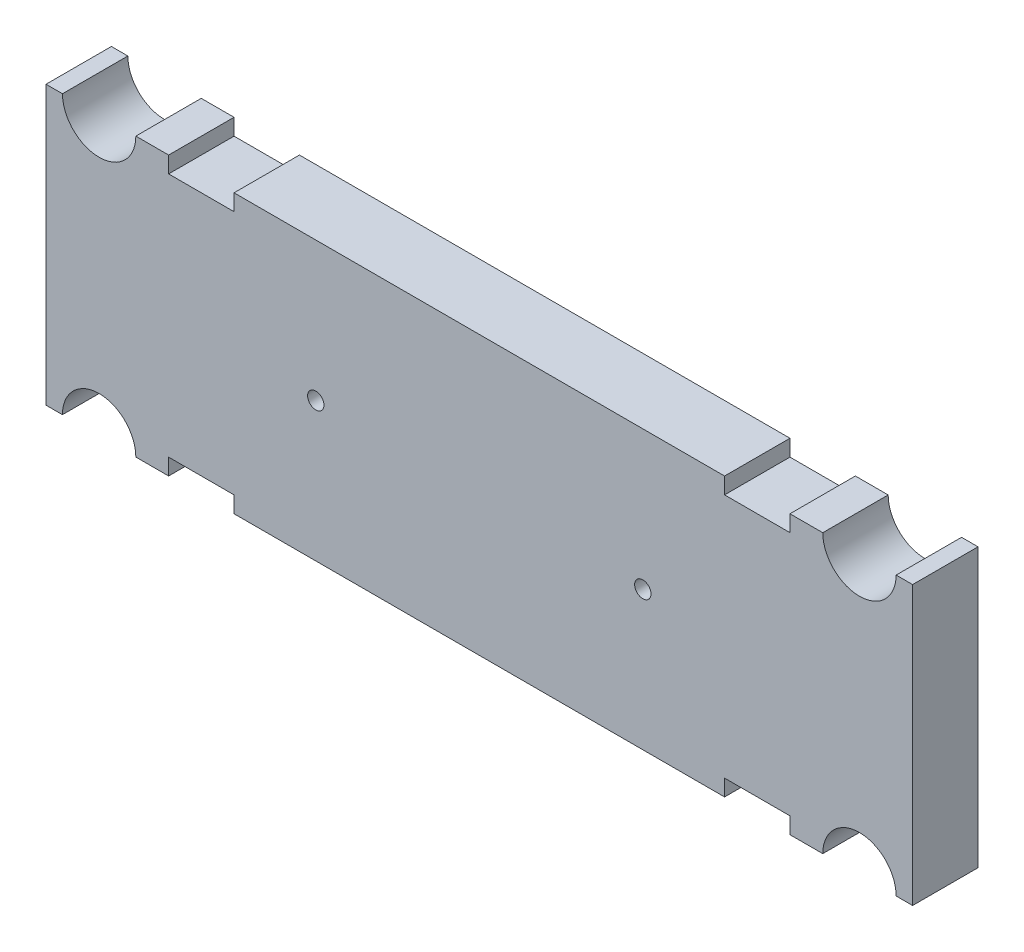
ISO-10303-21;
HEADER;
FILE_DESCRIPTION(('STEP AP214'),'2;1');
FILE_NAME('part.step','',(''),(''),'','','');
FILE_SCHEMA(('AUTOMOTIVE_DESIGN { 1 0 10303 214 1 1 1 1 }'));
ENDSEC;
DATA;
#1=APPLICATION_CONTEXT('core data for automotive mechanical design processes');
#2=APPLICATION_PROTOCOL_DEFINITION('international standard','automotive_design',2000,#1);
#3=PRODUCT_CONTEXT('',#1,'mechanical');
#4=PRODUCT('Part','Part','',(#3));
#5=PRODUCT_RELATED_PRODUCT_CATEGORY('part','',(#4));
#6=PRODUCT_DEFINITION_FORMATION('','',#4);
#7=PRODUCT_DEFINITION_CONTEXT('part definition',#1,'design');
#8=PRODUCT_DEFINITION('design','',#6,#7);
#9=PRODUCT_DEFINITION_SHAPE('','',#8);
#10=(LENGTH_UNIT() NAMED_UNIT(*) SI_UNIT(.MILLI.,.METRE.));
#11=(NAMED_UNIT(*) PLANE_ANGLE_UNIT() SI_UNIT($,.RADIAN.));
#12=(NAMED_UNIT(*) SI_UNIT($,.STERADIAN.) SOLID_ANGLE_UNIT());
#13=UNCERTAINTY_MEASURE_WITH_UNIT(LENGTH_MEASURE(1.E-05),#10,'distance_accuracy_value','');
#14=(GEOMETRIC_REPRESENTATION_CONTEXT(3) GLOBAL_UNCERTAINTY_ASSIGNED_CONTEXT((#13)) GLOBAL_UNIT_ASSIGNED_CONTEXT((#10,
#11,#12)) REPRESENTATION_CONTEXT('',''));
#15=CARTESIAN_POINT('',(0.,0.,0.));
#16=DIRECTION('',(0.,0.,1.));
#17=DIRECTION('',(1.,0.,0.));
#18=AXIS2_PLACEMENT_3D('',#15,#16,#17);
#19=CARTESIAN_POINT('',(23.2500000000001,8.50000000000001,4.));
#20=DIRECTION('',(0.,0.,-1.));
#21=DIRECTION('',(-1.,0.,0.));
#22=AXIS2_PLACEMENT_3D('',#19,#20,#21);
#23=CYLINDRICAL_SURFACE('',#22,2.24362106189331);
#24=CARTESIAN_POINT('',(23.2500000000001,8.50000000000001,0.));
#25=DIRECTION('',(0.,0.,-1.));
#26=DIRECTION('',(-1.,0.,0.));
#27=AXIS2_PLACEMENT_3D('',#24,#25,#26);
#28=CIRCLE('',#27,2.24362106189331);
#29=CARTESIAN_POINT('',(25.4936210618934,8.49999999999999,0.));
#30=VERTEX_POINT('',#29);
#31=CARTESIAN_POINT('',(21.0063789381067,8.5,0.));
#32=VERTEX_POINT('',#31);
#33=EDGE_CURVE('E247',#30,#32,#28,.T.);
#34=ORIENTED_EDGE('',*,*,#33,.T.);
#35=DIRECTION('',(0.,0.,-1.));
#36=VECTOR('',#35,1.);
#37=CARTESIAN_POINT('',(21.0063789381067,8.5,4.));
#38=LINE('',#37,#36);
#39=CARTESIAN_POINT('',(21.0063789381067,8.5,4.));
#40=VERTEX_POINT('',#39);
#41=EDGE_CURVE('E11',#40,#32,#38,.T.);
#42=ORIENTED_EDGE('',*,*,#41,.F.);
#43=CARTESIAN_POINT('',(23.2500000000001,8.50000000000001,4.));
#44=DIRECTION('',(0.,0.,-1.));
#45=DIRECTION('',(-1.,0.,0.));
#46=AXIS2_PLACEMENT_3D('',#43,#44,#45);
#47=CIRCLE('',#46,2.24362106189331);
#48=CARTESIAN_POINT('',(25.4936210618934,8.49999999999999,4.));
#49=VERTEX_POINT('',#48);
#50=EDGE_CURVE('E322',#49,#40,#47,.T.);
#51=ORIENTED_EDGE('',*,*,#50,.F.);
#52=DIRECTION('',(0.,0.,-1.));
#53=VECTOR('',#52,1.);
#54=CARTESIAN_POINT('',(25.4936210618934,8.49999999999999,4.));
#55=LINE('',#54,#53);
#56=EDGE_CURVE('E243',#49,#30,#55,.T.);
#57=ORIENTED_EDGE('',*,*,#56,.T.);
#58=EDGE_LOOP('',(#34,#42,#51,#57));
#59=FACE_BOUND('',#58,.T.);
#60=ADVANCED_FACE('F32',(#59),#23,.F.);
#61=CARTESIAN_POINT('',(21.0063789381067,8.5,4.));
#62=DIRECTION('',(0.,-1.,0.));
#63=DIRECTION('',(1.,0.,0.));
#64=AXIS2_PLACEMENT_3D('',#61,#62,#63);
#65=PLANE('',#64);
#66=DIRECTION('',(-1.,0.,0.));
#67=VECTOR('',#66,1.);
#68=CARTESIAN_POINT('',(21.0063789381067,8.5,0.));
#69=LINE('',#68,#67);
#70=CARTESIAN_POINT('',(19.,8.49999999999999,0.));
#71=VERTEX_POINT('',#70);
#72=EDGE_CURVE('E250',#32,#71,#69,.T.);
#73=ORIENTED_EDGE('',*,*,#72,.T.);
#74=DIRECTION('',(0.,0.,-1.));
#75=VECTOR('',#74,1.);
#76=CARTESIAN_POINT('',(19.,8.49999999999999,4.));
#77=LINE('',#76,#75);
#78=CARTESIAN_POINT('',(19.,8.49999999999999,4.));
#79=VERTEX_POINT('',#78);
#80=EDGE_CURVE('E40',#79,#71,#77,.T.);
#81=ORIENTED_EDGE('',*,*,#80,.F.);
#82=DIRECTION('',(-1.,0.,0.));
#83=VECTOR('',#82,1.);
#84=CARTESIAN_POINT('',(21.0063789381067,8.5,4.));
#85=LINE('',#84,#83);
#86=EDGE_CURVE('E147',#40,#79,#85,.T.);
#87=ORIENTED_EDGE('',*,*,#86,.F.);
#88=ORIENTED_EDGE('',*,*,#41,.T.);
#89=EDGE_LOOP('',(#73,#81,#87,#88));
#90=FACE_BOUND('',#89,.T.);
#91=ADVANCED_FACE('F466',(#90),#65,.F.);
#92=CARTESIAN_POINT('',(19.,8.49999999999999,4.));
#93=DIRECTION('',(1.,0.,0.));
#94=DIRECTION('',(0.,0.,-1.));
#95=AXIS2_PLACEMENT_3D('',#92,#93,#94);
#96=PLANE('',#95);
#97=DIRECTION('',(0.,-1.,0.));
#98=VECTOR('',#97,1.);
#99=CARTESIAN_POINT('',(19.,8.49999999999999,0.));
#100=LINE('',#99,#98);
#101=CARTESIAN_POINT('',(19.,7.5,0.));
#102=VERTEX_POINT('',#101);
#103=EDGE_CURVE('E253',#71,#102,#100,.T.);
#104=ORIENTED_EDGE('',*,*,#103,.T.);
#105=DIRECTION('',(0.,0.,-1.));
#106=VECTOR('',#105,1.);
#107=CARTESIAN_POINT('',(19.,7.5,4.));
#108=LINE('',#107,#106);
#109=CARTESIAN_POINT('',(19.,7.5,4.));
#110=VERTEX_POINT('',#109);
#111=EDGE_CURVE('E371',#110,#102,#108,.T.);
#112=ORIENTED_EDGE('',*,*,#111,.F.);
#113=DIRECTION('',(0.,-1.,0.));
#114=VECTOR('',#113,1.);
#115=CARTESIAN_POINT('',(19.,8.49999999999999,4.));
#116=LINE('',#115,#114);
#117=EDGE_CURVE('E379',#79,#110,#116,.T.);
#118=ORIENTED_EDGE('',*,*,#117,.F.);
#119=ORIENTED_EDGE('',*,*,#80,.T.);
#120=EDGE_LOOP('',(#104,#112,#118,#119));
#121=FACE_BOUND('',#120,.T.);
#122=ADVANCED_FACE('F377',(#121),#96,.F.);
#123=CARTESIAN_POINT('',(19.,7.5,4.));
#124=DIRECTION('',(0.,-1.,0.));
#125=DIRECTION('',(1.,0.,0.));
#126=AXIS2_PLACEMENT_3D('',#123,#124,#125);
#127=PLANE('',#126);
#128=DIRECTION('',(-1.,0.,0.));
#129=VECTOR('',#128,1.);
#130=CARTESIAN_POINT('',(19.,7.5,0.));
#131=LINE('',#130,#129);
#132=CARTESIAN_POINT('',(15.,7.5,0.));
#133=VERTEX_POINT('',#132);
#134=EDGE_CURVE('E255',#102,#133,#131,.T.);
#135=ORIENTED_EDGE('',*,*,#134,.T.);
#136=DIRECTION('',(0.,0.,-1.));
#137=VECTOR('',#136,1.);
#138=CARTESIAN_POINT('',(15.,7.5,4.));
#139=LINE('',#138,#137);
#140=CARTESIAN_POINT('',(15.,7.5,4.));
#141=VERTEX_POINT('',#140);
#142=EDGE_CURVE('E369',#141,#133,#139,.T.);
#143=ORIENTED_EDGE('',*,*,#142,.F.);
#144=DIRECTION('',(-1.,0.,0.));
#145=VECTOR('',#144,1.);
#146=CARTESIAN_POINT('',(19.,7.5,4.));
#147=LINE('',#146,#145);
#148=EDGE_CURVE('E391',#110,#141,#147,.T.);
#149=ORIENTED_EDGE('',*,*,#148,.F.);
#150=ORIENTED_EDGE('',*,*,#111,.T.);
#151=EDGE_LOOP('',(#135,#143,#149,#150));
#152=FACE_BOUND('',#151,.T.);
#153=ADVANCED_FACE('F388',(#152),#127,.F.);
#154=CARTESIAN_POINT('',(15.,8.5,4.));
#155=DIRECTION('',(1.,0.,0.));
#156=DIRECTION('',(0.,1.,0.));
#157=AXIS2_PLACEMENT_3D('',#154,#155,#156);
#158=PLANE('',#157);
#159=DIRECTION('',(0.,-1.,0.));
#160=VECTOR('',#159,1.);
#161=CARTESIAN_POINT('',(15.,8.5,0.));
#162=LINE('',#161,#160);
#163=CARTESIAN_POINT('',(15.,8.5,0.));
#164=VERTEX_POINT('',#163);
#165=EDGE_CURVE('E258',#164,#133,#162,.T.);
#166=ORIENTED_EDGE('',*,*,#165,.F.);
#167=DIRECTION('',(0.,0.,-1.));
#168=VECTOR('',#167,1.);
#169=CARTESIAN_POINT('',(15.,8.5,4.));
#170=LINE('',#169,#168);
#171=CARTESIAN_POINT('',(15.,8.5,4.));
#172=VERTEX_POINT('',#171);
#173=EDGE_CURVE('E367',#172,#164,#170,.T.);
#174=ORIENTED_EDGE('',*,*,#173,.F.);
#175=DIRECTION('',(0.,-1.,0.));
#176=VECTOR('',#175,1.);
#177=CARTESIAN_POINT('',(15.,8.5,4.));
#178=LINE('',#177,#176);
#179=EDGE_CURVE('E393',#172,#141,#178,.T.);
#180=ORIENTED_EDGE('',*,*,#179,.T.);
#181=ORIENTED_EDGE('',*,*,#142,.T.);
#182=EDGE_LOOP('',(#166,#174,#180,#181));
#183=FACE_BOUND('',#182,.T.);
#184=ADVANCED_FACE('F477',(#183),#158,.T.);
#185=CARTESIAN_POINT('',(15.,8.5,4.));
#186=DIRECTION('',(0.,-1.,0.));
#187=DIRECTION('',(1.,0.,0.));
#188=AXIS2_PLACEMENT_3D('',#185,#186,#187);
#189=PLANE('',#188);
#190=DIRECTION('',(-1.,0.,0.));
#191=VECTOR('',#190,1.);
#192=CARTESIAN_POINT('',(15.,8.5,0.));
#193=LINE('',#192,#191);
#194=CARTESIAN_POINT('',(-15.,8.50000000000001,0.));
#195=VERTEX_POINT('',#194);
#196=EDGE_CURVE('E261',#164,#195,#193,.T.);
#197=ORIENTED_EDGE('',*,*,#196,.T.);
#198=DIRECTION('',(0.,0.,-1.));
#199=VECTOR('',#198,1.);
#200=CARTESIAN_POINT('',(-15.,8.50000000000001,4.));
#201=LINE('',#200,#199);
#202=CARTESIAN_POINT('',(-15.,8.50000000000001,4.));
#203=VERTEX_POINT('',#202);
#204=EDGE_CURVE('E364',#203,#195,#201,.T.);
#205=ORIENTED_EDGE('',*,*,#204,.F.);
#206=DIRECTION('',(-1.,0.,0.));
#207=VECTOR('',#206,1.);
#208=CARTESIAN_POINT('',(15.,8.5,4.));
#209=LINE('',#208,#207);
#210=EDGE_CURVE('E395',#172,#203,#209,.T.);
#211=ORIENTED_EDGE('',*,*,#210,.F.);
#212=ORIENTED_EDGE('',*,*,#173,.T.);
#213=EDGE_LOOP('',(#197,#205,#211,#212));
#214=FACE_BOUND('',#213,.T.);
#215=ADVANCED_FACE('F480',(#214),#189,.F.);
#216=CARTESIAN_POINT('',(-15.,8.50000000000001,4.));
#217=DIRECTION('',(1.,0.,0.));
#218=DIRECTION('',(0.,1.,0.));
#219=AXIS2_PLACEMENT_3D('',#216,#217,#218);
#220=PLANE('',#219);
#221=DIRECTION('',(0.,-1.,0.));
#222=VECTOR('',#221,1.);
#223=CARTESIAN_POINT('',(-15.,8.50000000000001,0.));
#224=LINE('',#223,#222);
#225=CARTESIAN_POINT('',(-15.,7.50000000000001,0.));
#226=VERTEX_POINT('',#225);
#227=EDGE_CURVE('E263',#195,#226,#224,.T.);
#228=ORIENTED_EDGE('',*,*,#227,.T.);
#229=DIRECTION('',(0.,0.,-1.));
#230=VECTOR('',#229,1.);
#231=CARTESIAN_POINT('',(-15.,7.50000000000001,4.));
#232=LINE('',#231,#230);
#233=CARTESIAN_POINT('',(-15.,7.50000000000001,4.));
#234=VERTEX_POINT('',#233);
#235=EDGE_CURVE('E362',#234,#226,#232,.T.);
#236=ORIENTED_EDGE('',*,*,#235,.F.);
#237=DIRECTION('',(0.,-1.,0.));
#238=VECTOR('',#237,1.);
#239=CARTESIAN_POINT('',(-15.,8.50000000000001,4.));
#240=LINE('',#239,#238);
#241=EDGE_CURVE('E401',#203,#234,#240,.T.);
#242=ORIENTED_EDGE('',*,*,#241,.F.);
#243=ORIENTED_EDGE('',*,*,#204,.T.);
#244=EDGE_LOOP('',(#228,#236,#242,#243));
#245=FACE_BOUND('',#244,.T.);
#246=ADVANCED_FACE('F484',(#245),#220,.F.);
#247=CARTESIAN_POINT('',(-19.,7.50000000000001,4.));
#248=DIRECTION('',(0.,1.,0.));
#249=DIRECTION('',(-1.,0.,0.));
#250=AXIS2_PLACEMENT_3D('',#247,#248,#249);
#251=PLANE('',#250);
#252=DIRECTION('',(1.,0.,0.));
#253=VECTOR('',#252,1.);
#254=CARTESIAN_POINT('',(-19.,7.50000000000001,0.));
#255=LINE('',#254,#253);
#256=CARTESIAN_POINT('',(-19.,7.50000000000001,0.));
#257=VERTEX_POINT('',#256);
#258=EDGE_CURVE('E266',#257,#226,#255,.T.);
#259=ORIENTED_EDGE('',*,*,#258,.F.);
#260=DIRECTION('',(0.,0.,-1.));
#261=VECTOR('',#260,1.);
#262=CARTESIAN_POINT('',(-19.,7.50000000000001,4.));
#263=LINE('',#262,#261);
#264=CARTESIAN_POINT('',(-19.,7.50000000000001,4.));
#265=VERTEX_POINT('',#264);
#266=EDGE_CURVE('E360',#265,#257,#263,.T.);
#267=ORIENTED_EDGE('',*,*,#266,.F.);
#268=DIRECTION('',(1.,0.,0.));
#269=VECTOR('',#268,1.);
#270=CARTESIAN_POINT('',(-19.,7.50000000000001,4.));
#271=LINE('',#270,#269);
#272=EDGE_CURVE('E403',#265,#234,#271,.T.);
#273=ORIENTED_EDGE('',*,*,#272,.T.);
#274=ORIENTED_EDGE('',*,*,#235,.T.);
#275=EDGE_LOOP('',(#259,#267,#273,#274));
#276=FACE_BOUND('',#275,.T.);
#277=ADVANCED_FACE('F488',(#276),#251,.T.);
#278=CARTESIAN_POINT('',(-19.,8.5,4.));
#279=DIRECTION('',(1.,0.,0.));
#280=DIRECTION('',(0.,0.,-1.));
#281=AXIS2_PLACEMENT_3D('',#278,#279,#280);
#282=PLANE('',#281);
#283=DIRECTION('',(0.,-1.,0.));
#284=VECTOR('',#283,1.);
#285=CARTESIAN_POINT('',(-19.,8.5,0.));
#286=LINE('',#285,#284);
#287=CARTESIAN_POINT('',(-19.,8.5,0.));
#288=VERTEX_POINT('',#287);
#289=EDGE_CURVE('E269',#288,#257,#286,.T.);
#290=ORIENTED_EDGE('',*,*,#289,.F.);
#291=DIRECTION('',(0.,0.,-1.));
#292=VECTOR('',#291,1.);
#293=CARTESIAN_POINT('',(-19.,8.5,4.));
#294=LINE('',#293,#292);
#295=CARTESIAN_POINT('',(-19.,8.5,4.));
#296=VERTEX_POINT('',#295);
#297=EDGE_CURVE('E358',#296,#288,#294,.T.);
#298=ORIENTED_EDGE('',*,*,#297,.F.);
#299=DIRECTION('',(0.,-1.,0.));
#300=VECTOR('',#299,1.);
#301=CARTESIAN_POINT('',(-19.,8.5,4.));
#302=LINE('',#301,#300);
#303=EDGE_CURVE('E406',#296,#265,#302,.T.);
#304=ORIENTED_EDGE('',*,*,#303,.T.);
#305=ORIENTED_EDGE('',*,*,#266,.T.);
#306=EDGE_LOOP('',(#290,#298,#304,#305));
#307=FACE_BOUND('',#306,.T.);
#308=ADVANCED_FACE('F492',(#307),#282,.T.);
#309=CARTESIAN_POINT('',(-19.,8.5,4.));
#310=DIRECTION('',(0.,-1.,0.));
#311=DIRECTION('',(0.,0.,-1.));
#312=AXIS2_PLACEMENT_3D('',#309,#310,#311);
#313=PLANE('',#312);
#314=DIRECTION('',(-1.,0.,0.));
#315=VECTOR('',#314,1.);
#316=CARTESIAN_POINT('',(-19.,8.5,0.));
#317=LINE('',#316,#315);
#318=CARTESIAN_POINT('',(-21.0063789381067,8.5,0.));
#319=VERTEX_POINT('',#318);
#320=EDGE_CURVE('E272',#288,#319,#317,.T.);
#321=ORIENTED_EDGE('',*,*,#320,.T.);
#322=DIRECTION('',(0.,0.,-1.));
#323=VECTOR('',#322,1.);
#324=CARTESIAN_POINT('',(-21.0063789381067,8.5,4.));
#325=LINE('',#324,#323);
#326=CARTESIAN_POINT('',(-21.0063789381067,8.5,4.));
#327=VERTEX_POINT('',#326);
#328=EDGE_CURVE('E356',#327,#319,#325,.T.);
#329=ORIENTED_EDGE('',*,*,#328,.F.);
#330=DIRECTION('',(-1.,0.,0.));
#331=VECTOR('',#330,1.);
#332=CARTESIAN_POINT('',(-19.,8.5,4.));
#333=LINE('',#332,#331);
#334=EDGE_CURVE('E409',#296,#327,#333,.T.);
#335=ORIENTED_EDGE('',*,*,#334,.F.);
#336=ORIENTED_EDGE('',*,*,#297,.T.);
#337=EDGE_LOOP('',(#321,#329,#335,#336));
#338=FACE_BOUND('',#337,.T.);
#339=ADVANCED_FACE('F496',(#338),#313,.F.);
#340=CARTESIAN_POINT('',(-23.25,8.5,4.));
#341=DIRECTION('',(0.,0.,-1.));
#342=DIRECTION('',(-1.,0.,0.));
#343=AXIS2_PLACEMENT_3D('',#340,#341,#342);
#344=CYLINDRICAL_SURFACE('',#343,2.24362106189331);
#345=CARTESIAN_POINT('',(-23.25,8.5,0.));
#346=DIRECTION('',(0.,0.,1.));
#347=DIRECTION('',(1.,0.,0.));
#348=AXIS2_PLACEMENT_3D('',#345,#346,#347);
#349=CIRCLE('',#348,2.24362106189331);
#350=CARTESIAN_POINT('',(-25.4936210618934,8.5,0.));
#351=VERTEX_POINT('',#350);
#352=EDGE_CURVE('E275',#351,#319,#349,.T.);
#353=ORIENTED_EDGE('',*,*,#352,.F.);
#354=DIRECTION('',(0.,0.,-1.));
#355=VECTOR('',#354,1.);
#356=CARTESIAN_POINT('',(-25.4936210618934,8.5,4.));
#357=LINE('',#356,#355);
#358=CARTESIAN_POINT('',(-25.4936210618934,8.5,4.));
#359=VERTEX_POINT('',#358);
#360=EDGE_CURVE('E354',#359,#351,#357,.T.);
#361=ORIENTED_EDGE('',*,*,#360,.F.);
#362=CARTESIAN_POINT('',(-23.25,8.5,4.));
#363=DIRECTION('',(0.,0.,1.));
#364=DIRECTION('',(1.,0.,0.));
#365=AXIS2_PLACEMENT_3D('',#362,#363,#364);
#366=CIRCLE('',#365,2.24362106189331);
#367=EDGE_CURVE('E411',#359,#327,#366,.T.);
#368=ORIENTED_EDGE('',*,*,#367,.T.);
#369=ORIENTED_EDGE('',*,*,#328,.T.);
#370=EDGE_LOOP('',(#353,#361,#368,#369));
#371=FACE_BOUND('',#370,.T.);
#372=ADVANCED_FACE('F500',(#371),#344,.F.);
#373=CARTESIAN_POINT('',(-25.4936210618934,8.5,4.));
#374=DIRECTION('',(0.,-1.,0.));
#375=DIRECTION('',(0.,0.,-1.));
#376=AXIS2_PLACEMENT_3D('',#373,#374,#375);
#377=PLANE('',#376);
#378=DIRECTION('',(-1.,0.,0.));
#379=VECTOR('',#378,1.);
#380=CARTESIAN_POINT('',(-25.4936210618934,8.5,0.));
#381=LINE('',#380,#379);
#382=CARTESIAN_POINT('',(-26.5,8.5,0.));
#383=VERTEX_POINT('',#382);
#384=EDGE_CURVE('E278',#351,#383,#381,.T.);
#385=ORIENTED_EDGE('',*,*,#384,.T.);
#386=DIRECTION('',(0.,0.,-1.));
#387=VECTOR('',#386,1.);
#388=CARTESIAN_POINT('',(-26.5,8.5,4.));
#389=LINE('',#388,#387);
#390=CARTESIAN_POINT('',(-26.5,8.5,4.));
#391=VERTEX_POINT('',#390);
#392=EDGE_CURVE('E351',#391,#383,#389,.T.);
#393=ORIENTED_EDGE('',*,*,#392,.F.);
#394=DIRECTION('',(-1.,0.,0.));
#395=VECTOR('',#394,1.);
#396=CARTESIAN_POINT('',(-25.4936210618934,8.5,4.));
#397=LINE('',#396,#395);
#398=EDGE_CURVE('E414',#359,#391,#397,.T.);
#399=ORIENTED_EDGE('',*,*,#398,.F.);
#400=ORIENTED_EDGE('',*,*,#360,.T.);
#401=EDGE_LOOP('',(#385,#393,#399,#400));
#402=FACE_BOUND('',#401,.T.);
#403=ADVANCED_FACE('F504',(#402),#377,.F.);
#404=CARTESIAN_POINT('',(-26.5,8.5,4.));
#405=DIRECTION('',(1.,0.,0.));
#406=DIRECTION('',(0.,1.,0.));
#407=AXIS2_PLACEMENT_3D('',#404,#405,#406);
#408=PLANE('',#407);
#409=DIRECTION('',(0.,-1.,0.));
#410=VECTOR('',#409,1.);
#411=CARTESIAN_POINT('',(-26.5,8.5,0.));
#412=LINE('',#411,#410);
#413=CARTESIAN_POINT('',(-26.5,-8.5,0.));
#414=VERTEX_POINT('',#413);
#415=EDGE_CURVE('E280',#383,#414,#412,.T.);
#416=ORIENTED_EDGE('',*,*,#415,.T.);
#417=DIRECTION('',(0.,0.,-1.));
#418=VECTOR('',#417,1.);
#419=CARTESIAN_POINT('',(-26.5,-8.5,4.));
#420=LINE('',#419,#418);
#421=CARTESIAN_POINT('',(-26.5,-8.5,4.));
#422=VERTEX_POINT('',#421);
#423=EDGE_CURVE('E349',#422,#414,#420,.T.);
#424=ORIENTED_EDGE('',*,*,#423,.F.);
#425=DIRECTION('',(0.,-1.,0.));
#426=VECTOR('',#425,1.);
#427=CARTESIAN_POINT('',(-26.5,8.5,4.));
#428=LINE('',#427,#426);
#429=EDGE_CURVE('E416',#391,#422,#428,.T.);
#430=ORIENTED_EDGE('',*,*,#429,.F.);
#431=ORIENTED_EDGE('',*,*,#392,.T.);
#432=EDGE_LOOP('',(#416,#424,#430,#431));
#433=FACE_BOUND('',#432,.T.);
#434=ADVANCED_FACE('F508',(#433),#408,.F.);
#435=CARTESIAN_POINT('',(-25.4936210618934,-8.5,4.));
#436=DIRECTION('',(0.,-1.,0.));
#437=DIRECTION('',(0.,0.,-1.));
#438=AXIS2_PLACEMENT_3D('',#435,#436,#437);
#439=PLANE('',#438);
#440=DIRECTION('',(-1.,0.,0.));
#441=VECTOR('',#440,1.);
#442=CARTESIAN_POINT('',(-25.4936210618934,-8.5,0.));
#443=LINE('',#442,#441);
#444=CARTESIAN_POINT('',(-25.4936210618934,-8.5,0.));
#445=VERTEX_POINT('',#444);
#446=EDGE_CURVE('E283',#445,#414,#443,.T.);
#447=ORIENTED_EDGE('',*,*,#446,.F.);
#448=DIRECTION('',(0.,0.,-1.));
#449=VECTOR('',#448,1.);
#450=CARTESIAN_POINT('',(-25.4936210618934,-8.5,4.));
#451=LINE('',#450,#449);
#452=CARTESIAN_POINT('',(-25.4936210618934,-8.5,4.));
#453=VERTEX_POINT('',#452);
#454=EDGE_CURVE('E347',#453,#445,#451,.T.);
#455=ORIENTED_EDGE('',*,*,#454,.F.);
#456=DIRECTION('',(-1.,0.,0.));
#457=VECTOR('',#456,1.);
#458=CARTESIAN_POINT('',(-25.4936210618934,-8.5,4.));
#459=LINE('',#458,#457);
#460=EDGE_CURVE('E418',#453,#422,#459,.T.);
#461=ORIENTED_EDGE('',*,*,#460,.T.);
#462=ORIENTED_EDGE('',*,*,#423,.T.);
#463=EDGE_LOOP('',(#447,#455,#461,#462));
#464=FACE_BOUND('',#463,.T.);
#465=ADVANCED_FACE('F512',(#464),#439,.T.);
#466=CARTESIAN_POINT('',(-23.25,-8.5,4.));
#467=DIRECTION('',(0.,0.,-1.));
#468=DIRECTION('',(-1.,0.,0.));
#469=AXIS2_PLACEMENT_3D('',#466,#467,#468);
#470=CYLINDRICAL_SURFACE('',#469,2.24362106189331);
#471=CARTESIAN_POINT('',(-23.25,-8.5,0.));
#472=DIRECTION('',(0.,0.,-1.));
#473=DIRECTION('',(-1.,0.,0.));
#474=AXIS2_PLACEMENT_3D('',#471,#472,#473);
#475=CIRCLE('',#474,2.24362106189331);
#476=CARTESIAN_POINT('',(-21.0063789381067,-8.5,0.));
#477=VERTEX_POINT('',#476);
#478=EDGE_CURVE('E286',#445,#477,#475,.T.);
#479=ORIENTED_EDGE('',*,*,#478,.T.);
#480=DIRECTION('',(0.,0.,-1.));
#481=VECTOR('',#480,1.);
#482=CARTESIAN_POINT('',(-21.0063789381067,-8.5,4.));
#483=LINE('',#482,#481);
#484=CARTESIAN_POINT('',(-21.0063789381067,-8.5,4.));
#485=VERTEX_POINT('',#484);
#486=EDGE_CURVE('E345',#485,#477,#483,.T.);
#487=ORIENTED_EDGE('',*,*,#486,.F.);
#488=CARTESIAN_POINT('',(-23.25,-8.5,4.));
#489=DIRECTION('',(0.,0.,-1.));
#490=DIRECTION('',(-1.,0.,0.));
#491=AXIS2_PLACEMENT_3D('',#488,#489,#490);
#492=CIRCLE('',#491,2.24362106189331);
#493=EDGE_CURVE('E421',#453,#485,#492,.T.);
#494=ORIENTED_EDGE('',*,*,#493,.F.);
#495=ORIENTED_EDGE('',*,*,#454,.T.);
#496=EDGE_LOOP('',(#479,#487,#494,#495));
#497=FACE_BOUND('',#496,.T.);
#498=ADVANCED_FACE('F516',(#497),#470,.F.);
#499=CARTESIAN_POINT('',(-19.,-8.5,4.));
#500=DIRECTION('',(0.,-1.,0.));
#501=DIRECTION('',(0.,0.,-1.));
#502=AXIS2_PLACEMENT_3D('',#499,#500,#501);
#503=PLANE('',#502);
#504=DIRECTION('',(-1.,0.,0.));
#505=VECTOR('',#504,1.);
#506=CARTESIAN_POINT('',(-19.,-8.5,0.));
#507=LINE('',#506,#505);
#508=CARTESIAN_POINT('',(-19.,-8.5,0.));
#509=VERTEX_POINT('',#508);
#510=EDGE_CURVE('E289',#509,#477,#507,.T.);
#511=ORIENTED_EDGE('',*,*,#510,.F.);
#512=DIRECTION('',(0.,0.,-1.));
#513=VECTOR('',#512,1.);
#514=CARTESIAN_POINT('',(-19.,-8.5,4.));
#515=LINE('',#514,#513);
#516=CARTESIAN_POINT('',(-19.,-8.5,4.));
#517=VERTEX_POINT('',#516);
#518=EDGE_CURVE('E343',#517,#509,#515,.T.);
#519=ORIENTED_EDGE('',*,*,#518,.F.);
#520=DIRECTION('',(-1.,0.,0.));
#521=VECTOR('',#520,1.);
#522=CARTESIAN_POINT('',(-19.,-8.5,4.));
#523=LINE('',#522,#521);
#524=EDGE_CURVE('E423',#517,#485,#523,.T.);
#525=ORIENTED_EDGE('',*,*,#524,.T.);
#526=ORIENTED_EDGE('',*,*,#486,.T.);
#527=EDGE_LOOP('',(#511,#519,#525,#526));
#528=FACE_BOUND('',#527,.T.);
#529=ADVANCED_FACE('F520',(#528),#503,.T.);
#530=CARTESIAN_POINT('',(-19.,-8.5,4.));
#531=DIRECTION('',(-1.,0.,0.));
#532=DIRECTION('',(0.,0.,1.));
#533=AXIS2_PLACEMENT_3D('',#530,#531,#532);
#534=PLANE('',#533);
#535=DIRECTION('',(0.,1.,0.));
#536=VECTOR('',#535,1.);
#537=CARTESIAN_POINT('',(-19.,-8.5,0.));
#538=LINE('',#537,#536);
#539=CARTESIAN_POINT('',(-19.,-7.50000000000001,0.));
#540=VERTEX_POINT('',#539);
#541=EDGE_CURVE('E292',#509,#540,#538,.T.);
#542=ORIENTED_EDGE('',*,*,#541,.T.);
#543=DIRECTION('',(0.,0.,-1.));
#544=VECTOR('',#543,1.);
#545=CARTESIAN_POINT('',(-19.,-7.50000000000001,4.));
#546=LINE('',#545,#544);
#547=CARTESIAN_POINT('',(-19.,-7.50000000000001,4.));
#548=VERTEX_POINT('',#547);
#549=EDGE_CURVE('E340',#548,#540,#546,.T.);
#550=ORIENTED_EDGE('',*,*,#549,.F.);
#551=DIRECTION('',(0.,1.,0.));
#552=VECTOR('',#551,1.);
#553=CARTESIAN_POINT('',(-19.,-8.5,4.));
#554=LINE('',#553,#552);
#555=EDGE_CURVE('E426',#517,#548,#554,.T.);
#556=ORIENTED_EDGE('',*,*,#555,.F.);
#557=ORIENTED_EDGE('',*,*,#518,.T.);
#558=EDGE_LOOP('',(#542,#550,#556,#557));
#559=FACE_BOUND('',#558,.T.);
#560=ADVANCED_FACE('F524',(#559),#534,.F.);
#561=CARTESIAN_POINT('',(-19.,-7.50000000000001,4.));
#562=DIRECTION('',(0.,1.,0.));
#563=DIRECTION('',(-1.,0.,0.));
#564=AXIS2_PLACEMENT_3D('',#561,#562,#563);
#565=PLANE('',#564);
#566=DIRECTION('',(1.,0.,0.));
#567=VECTOR('',#566,1.);
#568=CARTESIAN_POINT('',(-19.,-7.50000000000001,0.));
#569=LINE('',#568,#567);
#570=CARTESIAN_POINT('',(-15.,-7.50000000000001,0.));
#571=VERTEX_POINT('',#570);
#572=EDGE_CURVE('E294',#540,#571,#569,.T.);
#573=ORIENTED_EDGE('',*,*,#572,.T.);
#574=DIRECTION('',(0.,0.,-1.));
#575=VECTOR('',#574,1.);
#576=CARTESIAN_POINT('',(-15.,-7.50000000000001,4.));
#577=LINE('',#576,#575);
#578=CARTESIAN_POINT('',(-15.,-7.50000000000001,4.));
#579=VERTEX_POINT('',#578);
#580=EDGE_CURVE('E338',#579,#571,#577,.T.);
#581=ORIENTED_EDGE('',*,*,#580,.F.);
#582=DIRECTION('',(1.,0.,0.));
#583=VECTOR('',#582,1.);
#584=CARTESIAN_POINT('',(-19.,-7.50000000000001,4.));
#585=LINE('',#584,#583);
#586=EDGE_CURVE('E428',#548,#579,#585,.T.);
#587=ORIENTED_EDGE('',*,*,#586,.F.);
#588=ORIENTED_EDGE('',*,*,#549,.T.);
#589=EDGE_LOOP('',(#573,#581,#587,#588));
#590=FACE_BOUND('',#589,.T.);
#591=ADVANCED_FACE('F528',(#590),#565,.F.);
#592=CARTESIAN_POINT('',(-15.,-8.50000000000001,4.));
#593=DIRECTION('',(-1.,0.,0.));
#594=DIRECTION('',(0.,-1.,0.));
#595=AXIS2_PLACEMENT_3D('',#592,#593,#594);
#596=PLANE('',#595);
#597=DIRECTION('',(0.,1.,0.));
#598=VECTOR('',#597,1.);
#599=CARTESIAN_POINT('',(-15.,-8.50000000000001,0.));
#600=LINE('',#599,#598);
#601=CARTESIAN_POINT('',(-15.,-8.50000000000001,0.));
#602=VERTEX_POINT('',#601);
#603=EDGE_CURVE('E297',#602,#571,#600,.T.);
#604=ORIENTED_EDGE('',*,*,#603,.F.);
#605=DIRECTION('',(0.,0.,-1.));
#606=VECTOR('',#605,1.);
#607=CARTESIAN_POINT('',(-15.,-8.50000000000001,4.));
#608=LINE('',#607,#606);
#609=CARTESIAN_POINT('',(-15.,-8.50000000000001,4.));
#610=VERTEX_POINT('',#609);
#611=EDGE_CURVE('E336',#610,#602,#608,.T.);
#612=ORIENTED_EDGE('',*,*,#611,.F.);
#613=DIRECTION('',(0.,1.,0.));
#614=VECTOR('',#613,1.);
#615=CARTESIAN_POINT('',(-15.,-8.50000000000001,4.));
#616=LINE('',#615,#614);
#617=EDGE_CURVE('E430',#610,#579,#616,.T.);
#618=ORIENTED_EDGE('',*,*,#617,.T.);
#619=ORIENTED_EDGE('',*,*,#580,.T.);
#620=EDGE_LOOP('',(#604,#612,#618,#619));
#621=FACE_BOUND('',#620,.T.);
#622=ADVANCED_FACE('F532',(#621),#596,.T.);
#623=CARTESIAN_POINT('',(15.,-8.5,4.));
#624=DIRECTION('',(0.,-1.,0.));
#625=DIRECTION('',(1.,0.,0.));
#626=AXIS2_PLACEMENT_3D('',#623,#624,#625);
#627=PLANE('',#626);
#628=DIRECTION('',(-1.,0.,0.));
#629=VECTOR('',#628,1.);
#630=CARTESIAN_POINT('',(15.,-8.5,0.));
#631=LINE('',#630,#629);
#632=CARTESIAN_POINT('',(15.,-8.5,0.));
#633=VERTEX_POINT('',#632);
#634=EDGE_CURVE('E300',#633,#602,#631,.T.);
#635=ORIENTED_EDGE('',*,*,#634,.F.);
#636=DIRECTION('',(0.,0.,-1.));
#637=VECTOR('',#636,1.);
#638=CARTESIAN_POINT('',(15.,-8.5,4.));
#639=LINE('',#638,#637);
#640=CARTESIAN_POINT('',(15.,-8.5,4.));
#641=VERTEX_POINT('',#640);
#642=EDGE_CURVE('E334',#641,#633,#639,.T.);
#643=ORIENTED_EDGE('',*,*,#642,.F.);
#644=DIRECTION('',(-1.,0.,0.));
#645=VECTOR('',#644,1.);
#646=CARTESIAN_POINT('',(15.,-8.5,4.));
#647=LINE('',#646,#645);
#648=EDGE_CURVE('E433',#641,#610,#647,.T.);
#649=ORIENTED_EDGE('',*,*,#648,.T.);
#650=ORIENTED_EDGE('',*,*,#611,.T.);
#651=EDGE_LOOP('',(#635,#643,#649,#650));
#652=FACE_BOUND('',#651,.T.);
#653=ADVANCED_FACE('F536',(#652),#627,.T.);
#654=CARTESIAN_POINT('',(15.,-8.5,4.));
#655=DIRECTION('',(-1.,0.,0.));
#656=DIRECTION('',(0.,-1.,0.));
#657=AXIS2_PLACEMENT_3D('',#654,#655,#656);
#658=PLANE('',#657);
#659=DIRECTION('',(0.,1.,0.));
#660=VECTOR('',#659,1.);
#661=CARTESIAN_POINT('',(15.,-8.5,0.));
#662=LINE('',#661,#660);
#663=CARTESIAN_POINT('',(15.,-7.5,0.));
#664=VERTEX_POINT('',#663);
#665=EDGE_CURVE('E303',#633,#664,#662,.T.);
#666=ORIENTED_EDGE('',*,*,#665,.T.);
#667=DIRECTION('',(0.,0.,-1.));
#668=VECTOR('',#667,1.);
#669=CARTESIAN_POINT('',(15.,-7.5,4.));
#670=LINE('',#669,#668);
#671=CARTESIAN_POINT('',(15.,-7.5,4.));
#672=VERTEX_POINT('',#671);
#673=EDGE_CURVE('E332',#672,#664,#670,.T.);
#674=ORIENTED_EDGE('',*,*,#673,.F.);
#675=DIRECTION('',(0.,1.,0.));
#676=VECTOR('',#675,1.);
#677=CARTESIAN_POINT('',(15.,-8.5,4.));
#678=LINE('',#677,#676);
#679=EDGE_CURVE('E436',#641,#672,#678,.T.);
#680=ORIENTED_EDGE('',*,*,#679,.F.);
#681=ORIENTED_EDGE('',*,*,#642,.T.);
#682=EDGE_LOOP('',(#666,#674,#680,#681));
#683=FACE_BOUND('',#682,.T.);
#684=ADVANCED_FACE('F540',(#683),#658,.F.);
#685=CARTESIAN_POINT('',(19.,-7.5,4.));
#686=DIRECTION('',(0.,-1.,0.));
#687=DIRECTION('',(1.,0.,0.));
#688=AXIS2_PLACEMENT_3D('',#685,#686,#687);
#689=PLANE('',#688);
#690=DIRECTION('',(-1.,0.,0.));
#691=VECTOR('',#690,1.);
#692=CARTESIAN_POINT('',(19.,-7.5,0.));
#693=LINE('',#692,#691);
#694=CARTESIAN_POINT('',(19.,-7.5,0.));
#695=VERTEX_POINT('',#694);
#696=EDGE_CURVE('E306',#695,#664,#693,.T.);
#697=ORIENTED_EDGE('',*,*,#696,.F.);
#698=DIRECTION('',(0.,0.,-1.));
#699=VECTOR('',#698,1.);
#700=CARTESIAN_POINT('',(19.,-7.5,4.));
#701=LINE('',#700,#699);
#702=CARTESIAN_POINT('',(19.,-7.5,4.));
#703=VERTEX_POINT('',#702);
#704=EDGE_CURVE('E330',#703,#695,#701,.T.);
#705=ORIENTED_EDGE('',*,*,#704,.F.);
#706=DIRECTION('',(-1.,0.,0.));
#707=VECTOR('',#706,1.);
#708=CARTESIAN_POINT('',(19.,-7.5,4.));
#709=LINE('',#708,#707);
#710=EDGE_CURVE('E438',#703,#672,#709,.T.);
#711=ORIENTED_EDGE('',*,*,#710,.T.);
#712=ORIENTED_EDGE('',*,*,#673,.T.);
#713=EDGE_LOOP('',(#697,#705,#711,#712));
#714=FACE_BOUND('',#713,.T.);
#715=ADVANCED_FACE('F544',(#714),#689,.T.);
#716=CARTESIAN_POINT('',(19.,-8.49999999999999,4.));
#717=DIRECTION('',(-1.,0.,0.));
#718=DIRECTION('',(0.,0.,1.));
#719=AXIS2_PLACEMENT_3D('',#716,#717,#718);
#720=PLANE('',#719);
#721=DIRECTION('',(0.,1.,0.));
#722=VECTOR('',#721,1.);
#723=CARTESIAN_POINT('',(19.,-8.49999999999999,0.));
#724=LINE('',#723,#722);
#725=CARTESIAN_POINT('',(19.,-8.49999999999999,0.));
#726=VERTEX_POINT('',#725);
#727=EDGE_CURVE('E309',#726,#695,#724,.T.);
#728=ORIENTED_EDGE('',*,*,#727,.F.);
#729=DIRECTION('',(0.,0.,-1.));
#730=VECTOR('',#729,1.);
#731=CARTESIAN_POINT('',(19.,-8.49999999999999,4.));
#732=LINE('',#731,#730);
#733=CARTESIAN_POINT('',(19.,-8.49999999999999,4.));
#734=VERTEX_POINT('',#733);
#735=EDGE_CURVE('E328',#734,#726,#732,.T.);
#736=ORIENTED_EDGE('',*,*,#735,.F.);
#737=DIRECTION('',(0.,1.,0.));
#738=VECTOR('',#737,1.);
#739=CARTESIAN_POINT('',(19.,-8.49999999999999,4.));
#740=LINE('',#739,#738);
#741=EDGE_CURVE('E441',#734,#703,#740,.T.);
#742=ORIENTED_EDGE('',*,*,#741,.T.);
#743=ORIENTED_EDGE('',*,*,#704,.T.);
#744=EDGE_LOOP('',(#728,#736,#742,#743));
#745=FACE_BOUND('',#744,.T.);
#746=ADVANCED_FACE('F548',(#745),#720,.T.);
#747=CARTESIAN_POINT('',(21.0063789381067,-8.5,4.));
#748=DIRECTION('',(0.,-1.,0.));
#749=DIRECTION('',(1.,0.,0.));
#750=AXIS2_PLACEMENT_3D('',#747,#748,#749);
#751=PLANE('',#750);
#752=DIRECTION('',(-1.,0.,0.));
#753=VECTOR('',#752,1.);
#754=CARTESIAN_POINT('',(21.0063789381067,-8.5,0.));
#755=LINE('',#754,#753);
#756=CARTESIAN_POINT('',(21.0063789381067,-8.5,0.));
#757=VERTEX_POINT('',#756);
#758=EDGE_CURVE('E312',#757,#726,#755,.T.);
#759=ORIENTED_EDGE('',*,*,#758,.F.);
#760=DIRECTION('',(0.,0.,-1.));
#761=VECTOR('',#760,1.);
#762=CARTESIAN_POINT('',(21.0063789381067,-8.5,4.));
#763=LINE('',#762,#761);
#764=CARTESIAN_POINT('',(21.0063789381067,-8.5,4.));
#765=VERTEX_POINT('',#764);
#766=EDGE_CURVE('E326',#765,#757,#763,.T.);
#767=ORIENTED_EDGE('',*,*,#766,.F.);
#768=DIRECTION('',(-1.,0.,0.));
#769=VECTOR('',#768,1.);
#770=CARTESIAN_POINT('',(21.0063789381067,-8.5,4.));
#771=LINE('',#770,#769);
#772=EDGE_CURVE('E444',#765,#734,#771,.T.);
#773=ORIENTED_EDGE('',*,*,#772,.T.);
#774=ORIENTED_EDGE('',*,*,#735,.T.);
#775=EDGE_LOOP('',(#759,#767,#773,#774));
#776=FACE_BOUND('',#775,.T.);
#777=ADVANCED_FACE('F552',(#776),#751,.T.);
#778=CARTESIAN_POINT('',(23.2500000000001,-8.49999999999999,4.));
#779=DIRECTION('',(0.,0.,-1.));
#780=DIRECTION('',(-1.,0.,0.));
#781=AXIS2_PLACEMENT_3D('',#778,#779,#780);
#782=CYLINDRICAL_SURFACE('',#781,2.24362106189331);
#783=CARTESIAN_POINT('',(23.2500000000001,-8.49999999999999,0.));
#784=DIRECTION('',(0.,0.,1.));
#785=DIRECTION('',(1.,0.,0.));
#786=AXIS2_PLACEMENT_3D('',#783,#784,#785);
#787=CIRCLE('',#786,2.24362106189331);
#788=CARTESIAN_POINT('',(25.4936210618934,-8.49999999999999,0.));
#789=VERTEX_POINT('',#788);
#790=EDGE_CURVE('E315',#789,#757,#787,.T.);
#791=ORIENTED_EDGE('',*,*,#790,.F.);
#792=DIRECTION('',(0.,0.,-1.));
#793=VECTOR('',#792,1.);
#794=CARTESIAN_POINT('',(25.4936210618934,-8.49999999999999,4.));
#795=LINE('',#794,#793);
#796=CARTESIAN_POINT('',(25.4936210618934,-8.49999999999999,4.));
#797=VERTEX_POINT('',#796);
#798=EDGE_CURVE('E232',#797,#789,#795,.T.);
#799=ORIENTED_EDGE('',*,*,#798,.F.);
#800=CARTESIAN_POINT('',(23.2500000000001,-8.49999999999999,4.));
#801=DIRECTION('',(0.,0.,1.));
#802=DIRECTION('',(1.,0.,0.));
#803=AXIS2_PLACEMENT_3D('',#800,#801,#802);
#804=CIRCLE('',#803,2.24362106189331);
#805=EDGE_CURVE('E239',#797,#765,#804,.T.);
#806=ORIENTED_EDGE('',*,*,#805,.T.);
#807=ORIENTED_EDGE('',*,*,#766,.T.);
#808=EDGE_LOOP('',(#791,#799,#806,#807));
#809=FACE_BOUND('',#808,.T.);
#810=ADVANCED_FACE('F448',(#809),#782,.F.);
#811=CARTESIAN_POINT('',(26.5,-8.50000000000001,4.));
#812=DIRECTION('',(0.,-1.,0.));
#813=DIRECTION('',(1.,0.,0.));
#814=AXIS2_PLACEMENT_3D('',#811,#812,#813);
#815=PLANE('',#814);
#816=DIRECTION('',(-1.,0.,0.));
#817=VECTOR('',#816,1.);
#818=CARTESIAN_POINT('',(26.5,-8.50000000000001,0.));
#819=LINE('',#818,#817);
#820=CARTESIAN_POINT('',(26.5,-8.50000000000001,0.));
#821=VERTEX_POINT('',#820);
#822=EDGE_CURVE('E227',#821,#789,#819,.T.);
#823=ORIENTED_EDGE('',*,*,#822,.F.);
#824=DIRECTION('',(0.,0.,-1.));
#825=VECTOR('',#824,1.);
#826=CARTESIAN_POINT('',(26.5,-8.50000000000001,4.));
#827=LINE('',#826,#825);
#828=CARTESIAN_POINT('',(26.5,-8.50000000000001,4.));
#829=VERTEX_POINT('',#828);
#830=EDGE_CURVE('E222',#829,#821,#827,.T.);
#831=ORIENTED_EDGE('',*,*,#830,.F.);
#832=DIRECTION('',(-1.,0.,0.));
#833=VECTOR('',#832,1.);
#834=CARTESIAN_POINT('',(26.5,-8.50000000000001,4.));
#835=LINE('',#834,#833);
#836=EDGE_CURVE('E225',#829,#797,#835,.T.);
#837=ORIENTED_EDGE('',*,*,#836,.T.);
#838=ORIENTED_EDGE('',*,*,#798,.T.);
#839=EDGE_LOOP('',(#823,#831,#837,#838));
#840=FACE_BOUND('',#839,.T.);
#841=ADVANCED_FACE('F224',(#840),#815,.T.);
#842=CARTESIAN_POINT('',(26.5,8.50000000000001,4.));
#843=DIRECTION('',(1.,0.,0.));
#844=DIRECTION('',(0.,0.,-1.));
#845=AXIS2_PLACEMENT_3D('',#842,#843,#844);
#846=PLANE('',#845);
#847=DIRECTION('',(0.,-1.,0.));
#848=VECTOR('',#847,1.);
#849=CARTESIAN_POINT('',(26.5,8.50000000000001,0.));
#850=LINE('',#849,#848);
#851=CARTESIAN_POINT('',(26.5,8.50000000000001,0.));
#852=VERTEX_POINT('',#851);
#853=EDGE_CURVE('E319',#852,#821,#850,.T.);
#854=ORIENTED_EDGE('',*,*,#853,.F.);
#855=DIRECTION('',(0.,0.,-1.));
#856=VECTOR('',#855,1.);
#857=CARTESIAN_POINT('',(26.5,8.50000000000001,4.));
#858=LINE('',#857,#856);
#859=CARTESIAN_POINT('',(26.5,8.50000000000001,4.));
#860=VERTEX_POINT('',#859);
#861=EDGE_CURVE('E136',#860,#852,#858,.T.);
#862=ORIENTED_EDGE('',*,*,#861,.F.);
#863=DIRECTION('',(0.,-1.,0.));
#864=VECTOR('',#863,1.);
#865=CARTESIAN_POINT('',(26.5,8.50000000000001,4.));
#866=LINE('',#865,#864);
#867=EDGE_CURVE('E236',#860,#829,#866,.T.);
#868=ORIENTED_EDGE('',*,*,#867,.T.);
#869=ORIENTED_EDGE('',*,*,#830,.T.);
#870=EDGE_LOOP('',(#854,#862,#868,#869));
#871=FACE_BOUND('',#870,.T.);
#872=ADVANCED_FACE('F241',(#871),#846,.T.);
#873=CARTESIAN_POINT('',(26.5,8.50000000000001,4.));
#874=DIRECTION('',(0.,-1.,0.));
#875=DIRECTION('',(1.,0.,0.));
#876=AXIS2_PLACEMENT_3D('',#873,#874,#875);
#877=PLANE('',#876);
#878=DIRECTION('',(-1.,0.,0.));
#879=VECTOR('',#878,1.);
#880=CARTESIAN_POINT('',(26.5,8.50000000000001,0.));
#881=LINE('',#880,#879);
#882=EDGE_CURVE('E139',#852,#30,#881,.T.);
#883=ORIENTED_EDGE('',*,*,#882,.T.);
#884=ORIENTED_EDGE('',*,*,#56,.F.);
#885=DIRECTION('',(-1.,0.,0.));
#886=VECTOR('',#885,1.);
#887=CARTESIAN_POINT('',(26.5,8.50000000000001,4.));
#888=LINE('',#887,#886);
#889=EDGE_CURVE('E48',#860,#49,#888,.T.);
#890=ORIENTED_EDGE('',*,*,#889,.F.);
#891=ORIENTED_EDGE('',*,*,#861,.T.);
#892=EDGE_LOOP('',(#883,#884,#890,#891));
#893=FACE_BOUND('',#892,.T.);
#894=ADVANCED_FACE('F453',(#893),#877,.F.);
#895=CARTESIAN_POINT('',(23.2500000000001,8.50000000000001,4.));
#896=DIRECTION('',(0.,0.,-1.));
#897=DIRECTION('',(-1.,0.,0.));
#898=AXIS2_PLACEMENT_3D('',#895,#896,#897);
#899=PLANE('',#898);
#900=CARTESIAN_POINT('',(-10.,0.,4.));
#901=DIRECTION('',(0.,0.,1.));
#902=DIRECTION('',(1.,0.,0.));
#903=AXIS2_PLACEMENT_3D('',#900,#901,#902);
#904=CIRCLE('',#903,0.500000000000001);
#905=CARTESIAN_POINT('',(-9.5,0.,4.));
#906=VERTEX_POINT('',#905);
#907=EDGE_CURVE('E251',#906,#906,#904,.T.);
#908=ORIENTED_EDGE('',*,*,#907,.F.);
#909=EDGE_LOOP('',(#908));
#910=FACE_BOUND('',#909,.T.);
#911=CARTESIAN_POINT('',(10.,0.,4.));
#912=DIRECTION('',(0.,0.,1.));
#913=DIRECTION('',(1.,0.,0.));
#914=AXIS2_PLACEMENT_3D('',#911,#912,#913);
#915=CIRCLE('',#914,0.500000000000001);
#916=CARTESIAN_POINT('',(10.5,0.,4.));
#917=VERTEX_POINT('',#916);
#918=EDGE_CURVE('E612',#917,#917,#915,.T.);
#919=ORIENTED_EDGE('',*,*,#918,.F.);
#920=EDGE_LOOP('',(#919));
#921=FACE_BOUND('',#920,.T.);
#922=ORIENTED_EDGE('',*,*,#50,.T.);
#923=ORIENTED_EDGE('',*,*,#86,.T.);
#924=ORIENTED_EDGE('',*,*,#117,.T.);
#925=ORIENTED_EDGE('',*,*,#148,.T.);
#926=ORIENTED_EDGE('',*,*,#179,.F.);
#927=ORIENTED_EDGE('',*,*,#210,.T.);
#928=ORIENTED_EDGE('',*,*,#241,.T.);
#929=ORIENTED_EDGE('',*,*,#272,.F.);
#930=ORIENTED_EDGE('',*,*,#303,.F.);
#931=ORIENTED_EDGE('',*,*,#334,.T.);
#932=ORIENTED_EDGE('',*,*,#367,.F.);
#933=ORIENTED_EDGE('',*,*,#398,.T.);
#934=ORIENTED_EDGE('',*,*,#429,.T.);
#935=ORIENTED_EDGE('',*,*,#460,.F.);
#936=ORIENTED_EDGE('',*,*,#493,.T.);
#937=ORIENTED_EDGE('',*,*,#524,.F.);
#938=ORIENTED_EDGE('',*,*,#555,.T.);
#939=ORIENTED_EDGE('',*,*,#586,.T.);
#940=ORIENTED_EDGE('',*,*,#617,.F.);
#941=ORIENTED_EDGE('',*,*,#648,.F.);
#942=ORIENTED_EDGE('',*,*,#679,.T.);
#943=ORIENTED_EDGE('',*,*,#710,.F.);
#944=ORIENTED_EDGE('',*,*,#741,.F.);
#945=ORIENTED_EDGE('',*,*,#772,.F.);
#946=ORIENTED_EDGE('',*,*,#805,.F.);
#947=ORIENTED_EDGE('',*,*,#836,.F.);
#948=ORIENTED_EDGE('',*,*,#867,.F.);
#949=ORIENTED_EDGE('',*,*,#889,.T.);
#950=EDGE_LOOP('',(#922,#923,#924,#925,#926,#927,#928,#929,#930,#931,#932,#933,#934,#935,#936,
#937,#938,#939,#940,#941,#942,#943,#944,#945,#946,#947,#948,#949));
#951=FACE_BOUND('',#950,.T.);
#952=ADVANCED_FACE('F235',(#910,#921,#951),#899,.F.);
#953=CARTESIAN_POINT('',(23.2500000000001,8.50000000000001,0.));
#954=DIRECTION('',(0.,0.,-1.));
#955=DIRECTION('',(-1.,0.,0.));
#956=AXIS2_PLACEMENT_3D('',#953,#954,#955);
#957=PLANE('',#956);
#958=CARTESIAN_POINT('',(-10.,0.,0.));
#959=DIRECTION('',(0.,0.,-1.));
#960=DIRECTION('',(-1.,0.,0.));
#961=AXIS2_PLACEMENT_3D('',#958,#959,#960);
#962=CIRCLE('',#961,0.500000000000001);
#963=CARTESIAN_POINT('',(-10.5,0.,0.));
#964=VERTEX_POINT('',#963);
#965=EDGE_CURVE('E608',#964,#964,#962,.F.);
#966=ORIENTED_EDGE('',*,*,#965,.T.);
#967=EDGE_LOOP('',(#966));
#968=FACE_BOUND('',#967,.T.);
#969=CARTESIAN_POINT('',(10.,0.,0.));
#970=DIRECTION('',(0.,0.,-1.));
#971=DIRECTION('',(-1.,0.,0.));
#972=AXIS2_PLACEMENT_3D('',#969,#970,#971);
#973=CIRCLE('',#972,0.500000000000001);
#974=CARTESIAN_POINT('',(9.5,0.,0.));
#975=VERTEX_POINT('',#974);
#976=EDGE_CURVE('E617',#975,#975,#973,.F.);
#977=ORIENTED_EDGE('',*,*,#976,.T.);
#978=EDGE_LOOP('',(#977));
#979=FACE_BOUND('',#978,.T.);
#980=ORIENTED_EDGE('',*,*,#33,.F.);
#981=ORIENTED_EDGE('',*,*,#882,.F.);
#982=ORIENTED_EDGE('',*,*,#853,.T.);
#983=ORIENTED_EDGE('',*,*,#822,.T.);
#984=ORIENTED_EDGE('',*,*,#790,.T.);
#985=ORIENTED_EDGE('',*,*,#758,.T.);
#986=ORIENTED_EDGE('',*,*,#727,.T.);
#987=ORIENTED_EDGE('',*,*,#696,.T.);
#988=ORIENTED_EDGE('',*,*,#665,.F.);
#989=ORIENTED_EDGE('',*,*,#634,.T.);
#990=ORIENTED_EDGE('',*,*,#603,.T.);
#991=ORIENTED_EDGE('',*,*,#572,.F.);
#992=ORIENTED_EDGE('',*,*,#541,.F.);
#993=ORIENTED_EDGE('',*,*,#510,.T.);
#994=ORIENTED_EDGE('',*,*,#478,.F.);
#995=ORIENTED_EDGE('',*,*,#446,.T.);
#996=ORIENTED_EDGE('',*,*,#415,.F.);
#997=ORIENTED_EDGE('',*,*,#384,.F.);
#998=ORIENTED_EDGE('',*,*,#352,.T.);
#999=ORIENTED_EDGE('',*,*,#320,.F.);
#1000=ORIENTED_EDGE('',*,*,#289,.T.);
#1001=ORIENTED_EDGE('',*,*,#258,.T.);
#1002=ORIENTED_EDGE('',*,*,#227,.F.);
#1003=ORIENTED_EDGE('',*,*,#196,.F.);
#1004=ORIENTED_EDGE('',*,*,#165,.T.);
#1005=ORIENTED_EDGE('',*,*,#134,.F.);
#1006=ORIENTED_EDGE('',*,*,#103,.F.);
#1007=ORIENTED_EDGE('',*,*,#72,.F.);
#1008=EDGE_LOOP('',(#980,#981,#982,#983,#984,#985,#986,#987,#988,#989,#990,#991,#992,#993,#994,
#995,#996,#997,#998,#999,#1000,#1001,#1002,#1003,#1004,#1005,#1006,#1007));
#1009=FACE_BOUND('',#1008,.T.);
#1010=ADVANCED_FACE('F383',(#968,#979,#1009),#957,.T.);
#1011=CARTESIAN_POINT('',(10.,0.,-0.00100000000000013));
#1012=DIRECTION('',(0.,0.,1.));
#1013=DIRECTION('',(1.,0.,0.));
#1014=AXIS2_PLACEMENT_3D('',#1011,#1012,#1013);
#1015=CYLINDRICAL_SURFACE('',#1014,0.500000000000001);
#1016=ORIENTED_EDGE('',*,*,#976,.F.);
#1017=EDGE_LOOP('',(#1016));
#1018=FACE_BOUND('',#1017,.T.);
#1019=ORIENTED_EDGE('',*,*,#918,.T.);
#1020=EDGE_LOOP('',(#1019));
#1021=FACE_BOUND('',#1020,.T.);
#1022=ADVANCED_FACE('F583',(#1018,#1021),#1015,.F.);
#1023=CARTESIAN_POINT('',(-10.,0.,-0.00100000000000013));
#1024=DIRECTION('',(0.,0.,1.));
#1025=DIRECTION('',(1.,0.,0.));
#1026=AXIS2_PLACEMENT_3D('',#1023,#1024,#1025);
#1027=CYLINDRICAL_SURFACE('',#1026,0.500000000000001);
#1028=ORIENTED_EDGE('',*,*,#965,.F.);
#1029=EDGE_LOOP('',(#1028));
#1030=FACE_BOUND('',#1029,.T.);
#1031=ORIENTED_EDGE('',*,*,#907,.T.);
#1032=EDGE_LOOP('',(#1031));
#1033=FACE_BOUND('',#1032,.T.);
#1034=ADVANCED_FACE('F591',(#1030,#1033),#1027,.F.);
#1035=CLOSED_SHELL('',(#60,#91,#122,#153,#184,#215,#246,#277,#308,#339,#372,#403,#434,#465,#498,
#529,#560,#591,#622,#653,#684,#715,#746,#777,#810,#841,#872,#894,#952,#1010,#1022,#1034));
#1036=MANIFOLD_SOLID_BREP('B2',#1035);
#1037=ADVANCED_BREP_SHAPE_REPRESENTATION('',(#18,#1036),#14);
#1038=SHAPE_DEFINITION_REPRESENTATION(#9,#1037);
ENDSEC;
END-ISO-10303-21;
